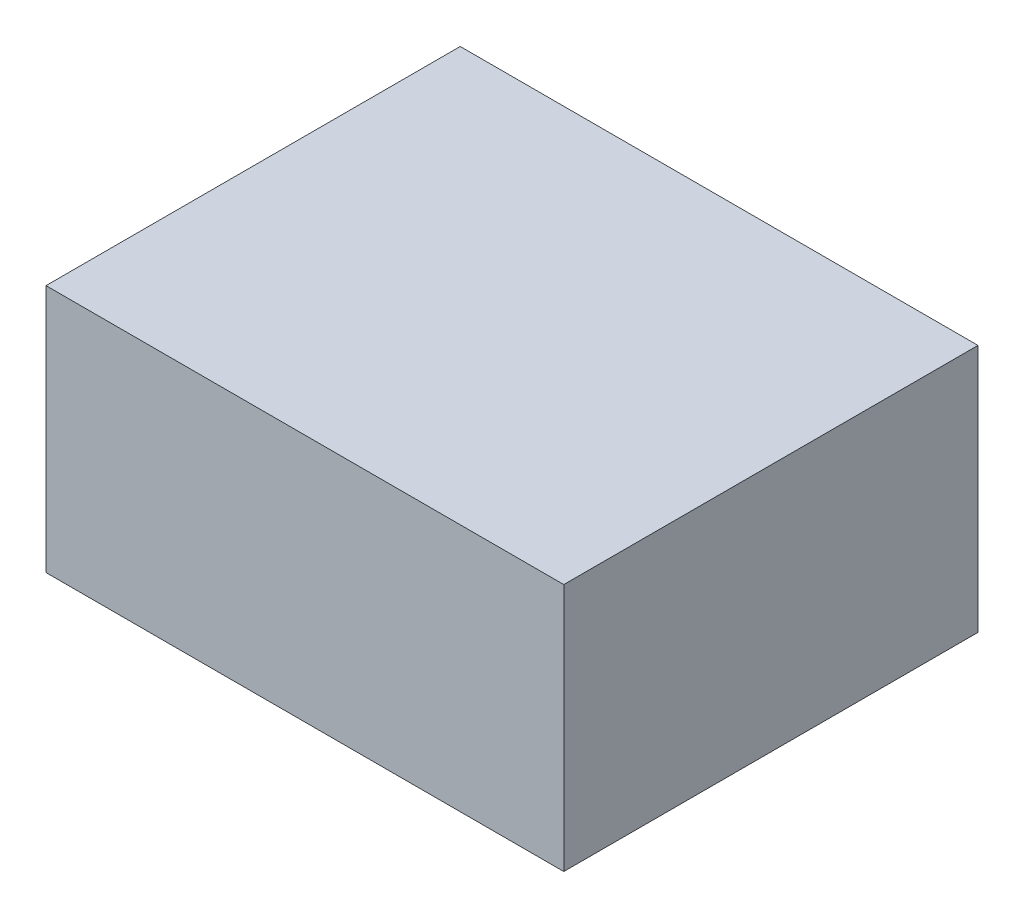
ISO-10303-21;
HEADER;
FILE_DESCRIPTION(('STEP AP214'),'2;1');
FILE_NAME('part.step','',(''),(''),'','','');
FILE_SCHEMA(('AUTOMOTIVE_DESIGN { 1 0 10303 214 1 1 1 1 }'));
ENDSEC;
DATA;
#1=APPLICATION_CONTEXT('core data for automotive mechanical design processes');
#2=APPLICATION_PROTOCOL_DEFINITION('international standard','automotive_design',2000,#1);
#3=PRODUCT_CONTEXT('',#1,'mechanical');
#4=PRODUCT('Part','Part','',(#3));
#5=PRODUCT_RELATED_PRODUCT_CATEGORY('part','',(#4));
#6=PRODUCT_DEFINITION_FORMATION('','',#4);
#7=PRODUCT_DEFINITION_CONTEXT('part definition',#1,'design');
#8=PRODUCT_DEFINITION('design','',#6,#7);
#9=PRODUCT_DEFINITION_SHAPE('','',#8);
#10=(LENGTH_UNIT() NAMED_UNIT(*) SI_UNIT(.MILLI.,.METRE.));
#11=(NAMED_UNIT(*) PLANE_ANGLE_UNIT() SI_UNIT($,.RADIAN.));
#12=(NAMED_UNIT(*) SI_UNIT($,.STERADIAN.) SOLID_ANGLE_UNIT());
#13=UNCERTAINTY_MEASURE_WITH_UNIT(LENGTH_MEASURE(1.E-05),#10,'distance_accuracy_value','');
#14=(GEOMETRIC_REPRESENTATION_CONTEXT(3) GLOBAL_UNCERTAINTY_ASSIGNED_CONTEXT((#13)) GLOBAL_UNIT_ASSIGNED_CONTEXT((#10,
#11,#12)) REPRESENTATION_CONTEXT('',''));
#15=CARTESIAN_POINT('',(0.,0.,0.));
#16=DIRECTION('',(0.,0.,1.));
#17=DIRECTION('',(1.,0.,0.));
#18=AXIS2_PLACEMENT_3D('',#15,#16,#17);
#19=CARTESIAN_POINT('',(0.,0.,0.));
#20=DIRECTION('',(0.,1.,0.));
#21=DIRECTION('',(0.,0.,1.));
#22=AXIS2_PLACEMENT_3D('',#19,#20,#21);
#23=PLANE('',#22);
#24=DIRECTION('',(-1.,0.,0.));
#25=VECTOR('',#24,1.);
#26=CARTESIAN_POINT('',(-1.25,0.,1.));
#27=LINE('',#26,#25);
#28=CARTESIAN_POINT('',(1.25,0.,1.));
#29=VERTEX_POINT('',#28);
#30=CARTESIAN_POINT('',(-1.25,0.,1.));
#31=VERTEX_POINT('',#30);
#32=EDGE_CURVE('E81',#29,#31,#27,.T.);
#33=ORIENTED_EDGE('',*,*,#32,.T.);
#34=DIRECTION('',(0.,0.,-1.));
#35=VECTOR('',#34,1.);
#36=CARTESIAN_POINT('',(-1.25,0.,-1.));
#37=LINE('',#36,#35);
#38=CARTESIAN_POINT('',(-1.25,0.,-1.));
#39=VERTEX_POINT('',#38);
#40=EDGE_CURVE('E68',#31,#39,#37,.T.);
#41=ORIENTED_EDGE('',*,*,#40,.T.);
#42=DIRECTION('',(1.,0.,0.));
#43=VECTOR('',#42,1.);
#44=CARTESIAN_POINT('',(-1.25,0.,-1.));
#45=LINE('',#44,#43);
#46=CARTESIAN_POINT('',(1.25,0.,-1.));
#47=VERTEX_POINT('',#46);
#48=EDGE_CURVE('E55',#39,#47,#45,.T.);
#49=ORIENTED_EDGE('',*,*,#48,.T.);
#50=DIRECTION('',(0.,0.,1.));
#51=VECTOR('',#50,1.);
#52=CARTESIAN_POINT('',(1.25,0.,-1.));
#53=LINE('',#52,#51);
#54=EDGE_CURVE('E20',#47,#29,#53,.T.);
#55=ORIENTED_EDGE('',*,*,#54,.T.);
#56=EDGE_LOOP('',(#33,#41,#49,#55));
#57=FACE_BOUND('',#56,.T.);
#58=ADVANCED_FACE('F17',(#57),#23,.F.);
#59=CARTESIAN_POINT('',(1.25,1.2,-1.));
#60=DIRECTION('',(-1.,0.,0.));
#61=DIRECTION('',(0.,0.,1.));
#62=AXIS2_PLACEMENT_3D('',#59,#60,#61);
#63=PLANE('',#62);
#64=DIRECTION('',(0.,1.,0.));
#65=VECTOR('',#64,1.);
#66=CARTESIAN_POINT('',(1.25,1.2,-1.));
#67=LINE('',#66,#65);
#68=CARTESIAN_POINT('',(1.25,1.2,-1.));
#69=VERTEX_POINT('',#68);
#70=EDGE_CURVE('E61',#47,#69,#67,.T.);
#71=ORIENTED_EDGE('',*,*,#70,.T.);
#72=DIRECTION('',(0.,0.,1.));
#73=VECTOR('',#72,1.);
#74=CARTESIAN_POINT('',(1.25,1.2,0.));
#75=LINE('',#74,#73);
#76=CARTESIAN_POINT('',(1.25,1.2,1.));
#77=VERTEX_POINT('',#76);
#78=EDGE_CURVE('E83',#77,#69,#75,.F.);
#79=ORIENTED_EDGE('',*,*,#78,.F.);
#80=DIRECTION('',(0.,1.,0.));
#81=VECTOR('',#80,1.);
#82=CARTESIAN_POINT('',(1.25,1.2,1.));
#83=LINE('',#82,#81);
#84=EDGE_CURVE('E64',#77,#29,#83,.F.);
#85=ORIENTED_EDGE('',*,*,#84,.T.);
#86=ORIENTED_EDGE('',*,*,#54,.F.);
#87=EDGE_LOOP('',(#71,#79,#85,#86));
#88=FACE_BOUND('',#87,.T.);
#89=ADVANCED_FACE('F60',(#88),#63,.F.);
#90=CARTESIAN_POINT('',(-1.25,1.2,-1.));
#91=DIRECTION('',(0.,0.,1.));
#92=DIRECTION('',(1.,0.,0.));
#93=AXIS2_PLACEMENT_3D('',#90,#91,#92);
#94=PLANE('',#93);
#95=DIRECTION('',(0.,1.,0.));
#96=VECTOR('',#95,1.);
#97=CARTESIAN_POINT('',(-1.25,1.2,-1.));
#98=LINE('',#97,#96);
#99=CARTESIAN_POINT('',(-1.25,1.2,-1.));
#100=VERTEX_POINT('',#99);
#101=EDGE_CURVE('E70',#39,#100,#98,.T.);
#102=ORIENTED_EDGE('',*,*,#101,.T.);
#103=DIRECTION('',(1.,0.,0.));
#104=VECTOR('',#103,1.);
#105=CARTESIAN_POINT('',(0.,1.2,-1.));
#106=LINE('',#105,#104);
#107=EDGE_CURVE('E74',#69,#100,#106,.F.);
#108=ORIENTED_EDGE('',*,*,#107,.F.);
#109=ORIENTED_EDGE('',*,*,#70,.F.);
#110=ORIENTED_EDGE('',*,*,#48,.F.);
#111=EDGE_LOOP('',(#102,#108,#109,#110));
#112=FACE_BOUND('',#111,.T.);
#113=ADVANCED_FACE('F72',(#112),#94,.F.);
#114=CARTESIAN_POINT('',(-1.25,1.2,-1.));
#115=DIRECTION('',(1.,0.,0.));
#116=DIRECTION('',(0.,0.,-1.));
#117=AXIS2_PLACEMENT_3D('',#114,#115,#116);
#118=PLANE('',#117);
#119=DIRECTION('',(0.,1.,0.));
#120=VECTOR('',#119,1.);
#121=CARTESIAN_POINT('',(-1.25,1.2,1.));
#122=LINE('',#121,#120);
#123=CARTESIAN_POINT('',(-1.25,1.2,1.));
#124=VERTEX_POINT('',#123);
#125=EDGE_CURVE('E35',#31,#124,#122,.T.);
#126=ORIENTED_EDGE('',*,*,#125,.T.);
#127=DIRECTION('',(0.,0.,1.));
#128=VECTOR('',#127,1.);
#129=CARTESIAN_POINT('',(-1.25,1.2,0.));
#130=LINE('',#129,#128);
#131=EDGE_CURVE('E26',#100,#124,#130,.T.);
#132=ORIENTED_EDGE('',*,*,#131,.F.);
#133=ORIENTED_EDGE('',*,*,#101,.F.);
#134=ORIENTED_EDGE('',*,*,#40,.F.);
#135=EDGE_LOOP('',(#126,#132,#133,#134));
#136=FACE_BOUND('',#135,.T.);
#137=ADVANCED_FACE('F89',(#136),#118,.F.);
#138=CARTESIAN_POINT('',(-1.25,1.2,1.));
#139=DIRECTION('',(0.,0.,-1.));
#140=DIRECTION('',(-1.,0.,0.));
#141=AXIS2_PLACEMENT_3D('',#138,#139,#140);
#142=PLANE('',#141);
#143=ORIENTED_EDGE('',*,*,#84,.F.);
#144=DIRECTION('',(1.,0.,0.));
#145=VECTOR('',#144,1.);
#146=CARTESIAN_POINT('',(0.,1.2,1.));
#147=LINE('',#146,#145);
#148=EDGE_CURVE('E11',#124,#77,#147,.T.);
#149=ORIENTED_EDGE('',*,*,#148,.F.);
#150=ORIENTED_EDGE('',*,*,#125,.F.);
#151=ORIENTED_EDGE('',*,*,#32,.F.);
#152=EDGE_LOOP('',(#143,#149,#150,#151));
#153=FACE_BOUND('',#152,.T.);
#154=ADVANCED_FACE('F91',(#153),#142,.F.);
#155=CARTESIAN_POINT('',(0.,1.2,0.));
#156=DIRECTION('',(0.,1.,0.));
#157=DIRECTION('',(0.,0.,1.));
#158=AXIS2_PLACEMENT_3D('',#155,#156,#157);
#159=PLANE('',#158);
#160=ORIENTED_EDGE('',*,*,#131,.T.);
#161=ORIENTED_EDGE('',*,*,#148,.T.);
#162=ORIENTED_EDGE('',*,*,#78,.T.);
#163=ORIENTED_EDGE('',*,*,#107,.T.);
#164=EDGE_LOOP('',(#160,#161,#162,#163));
#165=FACE_BOUND('',#164,.T.);
#166=ADVANCED_FACE('F88',(#165),#159,.T.);
#167=CLOSED_SHELL('',(#58,#89,#113,#137,#154,#166));
#168=MANIFOLD_SOLID_BREP('B1',#167);
#169=ADVANCED_BREP_SHAPE_REPRESENTATION('',(#18,#168),#14);
#170=SHAPE_DEFINITION_REPRESENTATION(#9,#169);
ENDSEC;
END-ISO-10303-21;
